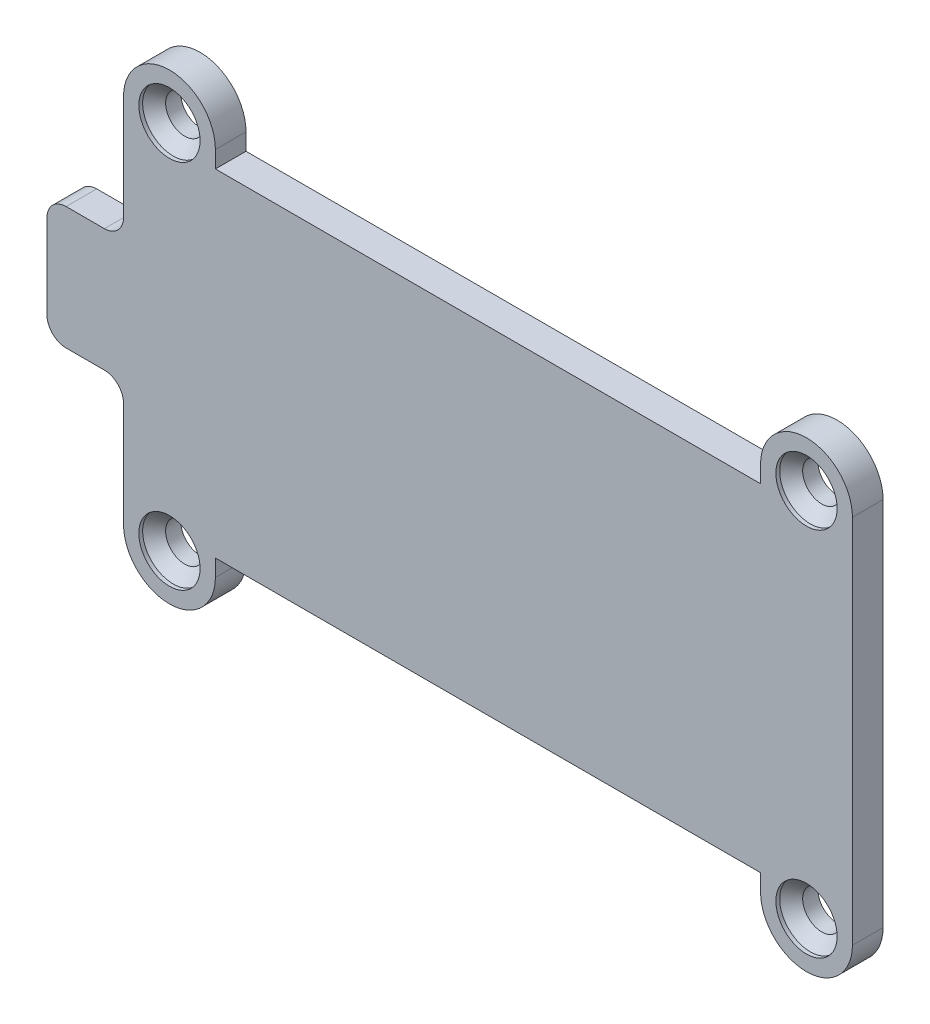
ISO-10303-21;
HEADER;
FILE_DESCRIPTION(('STEP AP214'),'2;1');
FILE_NAME('part.step','',(''),(''),'','','');
FILE_SCHEMA(('AUTOMOTIVE_DESIGN { 1 0 10303 214 1 1 1 1 }'));
ENDSEC;
DATA;
#1=APPLICATION_CONTEXT('core data for automotive mechanical design processes');
#2=APPLICATION_PROTOCOL_DEFINITION('international standard','automotive_design',2000,#1);
#3=PRODUCT_CONTEXT('',#1,'mechanical');
#4=PRODUCT('Part','Part','',(#3));
#5=PRODUCT_RELATED_PRODUCT_CATEGORY('part','',(#4));
#6=PRODUCT_DEFINITION_FORMATION('','',#4);
#7=PRODUCT_DEFINITION_CONTEXT('part definition',#1,'design');
#8=PRODUCT_DEFINITION('design','',#6,#7);
#9=PRODUCT_DEFINITION_SHAPE('','',#8);
#10=(LENGTH_UNIT() NAMED_UNIT(*) SI_UNIT(.MILLI.,.METRE.));
#11=(NAMED_UNIT(*) PLANE_ANGLE_UNIT() SI_UNIT($,.RADIAN.));
#12=(NAMED_UNIT(*) SI_UNIT($,.STERADIAN.) SOLID_ANGLE_UNIT());
#13=UNCERTAINTY_MEASURE_WITH_UNIT(LENGTH_MEASURE(1.E-05),#10,'distance_accuracy_value','');
#14=(GEOMETRIC_REPRESENTATION_CONTEXT(3) GLOBAL_UNCERTAINTY_ASSIGNED_CONTEXT((#13)) GLOBAL_UNIT_ASSIGNED_CONTEXT((#10,
#11,#12)) REPRESENTATION_CONTEXT('',''));
#15=CARTESIAN_POINT('',(0.,0.,0.));
#16=DIRECTION('',(0.,0.,1.));
#17=DIRECTION('',(1.,0.,0.));
#18=AXIS2_PLACEMENT_3D('',#15,#16,#17);
#19=CARTESIAN_POINT('',(-25.0500000000001,5.25,2.));
#20=DIRECTION('',(0.,0.,1.));
#21=DIRECTION('',(1.,0.,0.));
#22=AXIS2_PLACEMENT_3D('',#19,#20,#21);
#23=PLANE('',#22);
#24=CARTESIAN_POINT('',(-20.8,12.1,2.));
#25=DIRECTION('',(0.,0.,1.));
#26=DIRECTION('',(1.,0.,0.));
#27=AXIS2_PLACEMENT_3D('',#24,#25,#26);
#28=CIRCLE('',#27,2.);
#29=CARTESIAN_POINT('',(-18.8,12.1,2.));
#30=VERTEX_POINT('',#29);
#31=EDGE_CURVE('E450',#30,#30,#28,.T.);
#32=ORIENTED_EDGE('',*,*,#31,.F.);
#33=EDGE_LOOP('',(#32));
#34=FACE_BOUND('',#33,.T.);
#35=CARTESIAN_POINT('',(20.8,12.1,2.));
#36=DIRECTION('',(0.,0.,1.));
#37=DIRECTION('',(1.,0.,0.));
#38=AXIS2_PLACEMENT_3D('',#35,#36,#37);
#39=CIRCLE('',#38,2.);
#40=CARTESIAN_POINT('',(22.8,12.1,2.));
#41=VERTEX_POINT('',#40);
#42=EDGE_CURVE('E309',#41,#41,#39,.T.);
#43=ORIENTED_EDGE('',*,*,#42,.F.);
#44=EDGE_LOOP('',(#43));
#45=FACE_BOUND('',#44,.T.);
#46=CARTESIAN_POINT('',(20.8,-12.1,2.));
#47=DIRECTION('',(0.,0.,1.));
#48=DIRECTION('',(1.,0.,0.));
#49=AXIS2_PLACEMENT_3D('',#46,#47,#48);
#50=CIRCLE('',#49,2.);
#51=CARTESIAN_POINT('',(22.8,-12.1,2.));
#52=VERTEX_POINT('',#51);
#53=EDGE_CURVE('E302',#52,#52,#50,.T.);
#54=ORIENTED_EDGE('',*,*,#53,.F.);
#55=EDGE_LOOP('',(#54));
#56=FACE_BOUND('',#55,.T.);
#57=CARTESIAN_POINT('',(-20.8,-12.1,2.));
#58=DIRECTION('',(0.,0.,1.));
#59=DIRECTION('',(1.,0.,0.));
#60=AXIS2_PLACEMENT_3D('',#57,#58,#59);
#61=CIRCLE('',#60,2.);
#62=CARTESIAN_POINT('',(-18.8,-12.1,2.));
#63=VERTEX_POINT('',#62);
#64=EDGE_CURVE('E298',#63,#63,#61,.T.);
#65=ORIENTED_EDGE('',*,*,#64,.F.);
#66=EDGE_LOOP('',(#65));
#67=FACE_BOUND('',#66,.T.);
#68=CARTESIAN_POINT('',(-25.0500000000001,5.25,2.));
#69=DIRECTION('',(0.,0.,-1.));
#70=DIRECTION('',(1.,0.,0.));
#71=AXIS2_PLACEMENT_3D('',#68,#69,#70);
#72=CIRCLE('',#71,1.25);
#73=CARTESIAN_POINT('',(-23.8000000000001,5.24999999999998,2.));
#74=VERTEX_POINT('',#73);
#75=CARTESIAN_POINT('',(-25.0500000000001,4.,2.));
#76=VERTEX_POINT('',#75);
#77=EDGE_CURVE('E243',#74,#76,#72,.T.);
#78=ORIENTED_EDGE('',*,*,#77,.T.);
#79=DIRECTION('',(-1.,0.,0.));
#80=VECTOR('',#79,1.);
#81=CARTESIAN_POINT('',(-25.0500000000001,4.,2.));
#82=LINE('',#81,#80);
#83=CARTESIAN_POINT('',(-27.55,4.,2.));
#84=VERTEX_POINT('',#83);
#85=EDGE_CURVE('E131',#76,#84,#82,.T.);
#86=ORIENTED_EDGE('',*,*,#85,.T.);
#87=CARTESIAN_POINT('',(-27.55,2.75,2.));
#88=DIRECTION('',(0.,0.,1.));
#89=DIRECTION('',(1.,0.,0.));
#90=AXIS2_PLACEMENT_3D('',#87,#88,#89);
#91=CIRCLE('',#90,1.25);
#92=CARTESIAN_POINT('',(-28.8,2.75,2.));
#93=VERTEX_POINT('',#92);
#94=EDGE_CURVE('E335',#84,#93,#91,.T.);
#95=ORIENTED_EDGE('',*,*,#94,.T.);
#96=DIRECTION('',(0.,-1.,0.));
#97=VECTOR('',#96,1.);
#98=CARTESIAN_POINT('',(-28.8,2.75,2.));
#99=LINE('',#98,#97);
#100=CARTESIAN_POINT('',(-28.8,-2.75,2.));
#101=VERTEX_POINT('',#100);
#102=EDGE_CURVE('E337',#93,#101,#99,.T.);
#103=ORIENTED_EDGE('',*,*,#102,.T.);
#104=CARTESIAN_POINT('',(-27.55,-2.75,2.));
#105=DIRECTION('',(0.,0.,1.));
#106=DIRECTION('',(1.,0.,0.));
#107=AXIS2_PLACEMENT_3D('',#104,#105,#106);
#108=CIRCLE('',#107,1.25);
#109=CARTESIAN_POINT('',(-27.55,-4.,2.));
#110=VERTEX_POINT('',#109);
#111=EDGE_CURVE('E339',#101,#110,#108,.T.);
#112=ORIENTED_EDGE('',*,*,#111,.T.);
#113=DIRECTION('',(1.,0.,0.));
#114=VECTOR('',#113,1.);
#115=CARTESIAN_POINT('',(-27.55,-4.,2.));
#116=LINE('',#115,#114);
#117=CARTESIAN_POINT('',(-25.05,-4.,2.));
#118=VERTEX_POINT('',#117);
#119=EDGE_CURVE('E341',#110,#118,#116,.T.);
#120=ORIENTED_EDGE('',*,*,#119,.T.);
#121=CARTESIAN_POINT('',(-25.05,-5.25,2.));
#122=DIRECTION('',(0.,0.,-1.));
#123=DIRECTION('',(1.,0.,0.));
#124=AXIS2_PLACEMENT_3D('',#121,#122,#123);
#125=CIRCLE('',#124,1.25);
#126=CARTESIAN_POINT('',(-23.8,-5.25,2.));
#127=VERTEX_POINT('',#126);
#128=EDGE_CURVE('E343',#118,#127,#125,.T.);
#129=ORIENTED_EDGE('',*,*,#128,.T.);
#130=DIRECTION('',(0.,-1.,0.));
#131=VECTOR('',#130,1.);
#132=CARTESIAN_POINT('',(-23.8,-5.25,2.));
#133=LINE('',#132,#131);
#134=CARTESIAN_POINT('',(-23.8,-12.1,2.));
#135=VERTEX_POINT('',#134);
#136=EDGE_CURVE('E345',#127,#135,#133,.T.);
#137=ORIENTED_EDGE('',*,*,#136,.T.);
#138=CARTESIAN_POINT('',(-20.8,-12.1,2.));
#139=DIRECTION('',(0.,0.,1.));
#140=DIRECTION('',(1.,0.,0.));
#141=AXIS2_PLACEMENT_3D('',#138,#139,#140);
#142=CIRCLE('',#141,3.);
#143=CARTESIAN_POINT('',(-17.8,-12.1,2.));
#144=VERTEX_POINT('',#143);
#145=EDGE_CURVE('E347',#135,#144,#142,.T.);
#146=ORIENTED_EDGE('',*,*,#145,.T.);
#147=DIRECTION('',(0.,1.,0.));
#148=VECTOR('',#147,1.);
#149=CARTESIAN_POINT('',(-17.8,-12.1,2.));
#150=LINE('',#149,#148);
#151=CARTESIAN_POINT('',(-17.8,-11.,2.));
#152=VERTEX_POINT('',#151);
#153=EDGE_CURVE('E349',#144,#152,#150,.T.);
#154=ORIENTED_EDGE('',*,*,#153,.T.);
#155=DIRECTION('',(1.,0.,0.));
#156=VECTOR('',#155,1.);
#157=CARTESIAN_POINT('',(-17.8,-11.,2.));
#158=LINE('',#157,#156);
#159=CARTESIAN_POINT('',(17.8,-11.,2.));
#160=VERTEX_POINT('',#159);
#161=EDGE_CURVE('E351',#152,#160,#158,.T.);
#162=ORIENTED_EDGE('',*,*,#161,.T.);
#163=DIRECTION('',(0.,-1.,0.));
#164=VECTOR('',#163,1.);
#165=CARTESIAN_POINT('',(17.8,-11.,2.));
#166=LINE('',#165,#164);
#167=CARTESIAN_POINT('',(17.8,-12.1,2.));
#168=VERTEX_POINT('',#167);
#169=EDGE_CURVE('E353',#160,#168,#166,.T.);
#170=ORIENTED_EDGE('',*,*,#169,.T.);
#171=CARTESIAN_POINT('',(20.8,-12.1,2.));
#172=DIRECTION('',(0.,0.,1.));
#173=DIRECTION('',(1.,0.,0.));
#174=AXIS2_PLACEMENT_3D('',#171,#172,#173);
#175=CIRCLE('',#174,3.);
#176=CARTESIAN_POINT('',(23.8,-12.1,2.));
#177=VERTEX_POINT('',#176);
#178=EDGE_CURVE('E355',#168,#177,#175,.T.);
#179=ORIENTED_EDGE('',*,*,#178,.T.);
#180=DIRECTION('',(0.,1.,0.));
#181=VECTOR('',#180,1.);
#182=CARTESIAN_POINT('',(23.8,12.1,2.));
#183=LINE('',#182,#181);
#184=CARTESIAN_POINT('',(23.8,12.1,2.));
#185=VERTEX_POINT('',#184);
#186=EDGE_CURVE('E357',#177,#185,#183,.T.);
#187=ORIENTED_EDGE('',*,*,#186,.T.);
#188=CARTESIAN_POINT('',(20.8,12.1,2.));
#189=DIRECTION('',(0.,0.,1.));
#190=DIRECTION('',(1.,0.,0.));
#191=AXIS2_PLACEMENT_3D('',#188,#189,#190);
#192=CIRCLE('',#191,3.);
#193=CARTESIAN_POINT('',(17.8,12.1,2.));
#194=VERTEX_POINT('',#193);
#195=EDGE_CURVE('E359',#185,#194,#192,.T.);
#196=ORIENTED_EDGE('',*,*,#195,.T.);
#197=DIRECTION('',(0.,-1.,0.));
#198=VECTOR('',#197,1.);
#199=CARTESIAN_POINT('',(17.8,12.1,2.));
#200=LINE('',#199,#198);
#201=CARTESIAN_POINT('',(17.8,11.,2.));
#202=VERTEX_POINT('',#201);
#203=EDGE_CURVE('E361',#194,#202,#200,.T.);
#204=ORIENTED_EDGE('',*,*,#203,.T.);
#205=DIRECTION('',(-1.,0.,0.));
#206=VECTOR('',#205,1.);
#207=CARTESIAN_POINT('',(17.8,11.,2.));
#208=LINE('',#207,#206);
#209=CARTESIAN_POINT('',(-17.8,11.,2.));
#210=VERTEX_POINT('',#209);
#211=EDGE_CURVE('E185',#202,#210,#208,.T.);
#212=ORIENTED_EDGE('',*,*,#211,.T.);
#213=DIRECTION('',(0.,1.,0.));
#214=VECTOR('',#213,1.);
#215=CARTESIAN_POINT('',(-17.8,11.,2.));
#216=LINE('',#215,#214);
#217=CARTESIAN_POINT('',(-17.8,12.1,2.));
#218=VERTEX_POINT('',#217);
#219=EDGE_CURVE('E180',#210,#218,#216,.T.);
#220=ORIENTED_EDGE('',*,*,#219,.T.);
#221=CARTESIAN_POINT('',(-20.8,12.1,2.));
#222=DIRECTION('',(0.,0.,1.));
#223=DIRECTION('',(1.,0.,0.));
#224=AXIS2_PLACEMENT_3D('',#221,#222,#223);
#225=CIRCLE('',#224,3.);
#226=CARTESIAN_POINT('',(-23.8,12.1,2.));
#227=VERTEX_POINT('',#226);
#228=EDGE_CURVE('E183',#218,#227,#225,.T.);
#229=ORIENTED_EDGE('',*,*,#228,.T.);
#230=DIRECTION('',(0.,-1.,0.));
#231=VECTOR('',#230,1.);
#232=CARTESIAN_POINT('',(-23.8,12.1,2.));
#233=LINE('',#232,#231);
#234=EDGE_CURVE('E52',#227,#74,#233,.T.);
#235=ORIENTED_EDGE('',*,*,#234,.T.);
#236=EDGE_LOOP('',(#78,#86,#95,#103,#112,#120,#129,#137,#146,#154,#162,#170,#179,#187,#196,#204,
#212,#220,#229,#235));
#237=FACE_BOUND('',#236,.T.);
#238=ADVANCED_FACE('F33',(#34,#45,#56,#67,#237),#23,.T.);
#239=CARTESIAN_POINT('',(-25.0500000000001,5.25,0.));
#240=DIRECTION('',(0.,0.,1.));
#241=DIRECTION('',(1.,0.,0.));
#242=AXIS2_PLACEMENT_3D('',#239,#240,#241);
#243=PLANE('',#242);
#244=CARTESIAN_POINT('',(-25.0500000000001,5.25,0.));
#245=DIRECTION('',(0.,0.,-1.));
#246=DIRECTION('',(1.,0.,0.));
#247=AXIS2_PLACEMENT_3D('',#244,#245,#246);
#248=CIRCLE('',#247,1.25);
#249=CARTESIAN_POINT('',(-23.8000000000001,5.24999999999998,0.));
#250=VERTEX_POINT('',#249);
#251=CARTESIAN_POINT('',(-25.0500000000001,4.,0.));
#252=VERTEX_POINT('',#251);
#253=EDGE_CURVE('E203',#250,#252,#248,.T.);
#254=ORIENTED_EDGE('',*,*,#253,.F.);
#255=DIRECTION('',(0.,-1.,0.));
#256=VECTOR('',#255,1.);
#257=CARTESIAN_POINT('',(-23.8,12.1,0.));
#258=LINE('',#257,#256);
#259=CARTESIAN_POINT('',(-23.8,12.1,0.));
#260=VERTEX_POINT('',#259);
#261=EDGE_CURVE('E123',#260,#250,#258,.T.);
#262=ORIENTED_EDGE('',*,*,#261,.F.);
#263=CARTESIAN_POINT('',(-20.8,12.1,0.));
#264=DIRECTION('',(0.,0.,1.));
#265=DIRECTION('',(1.,0.,0.));
#266=AXIS2_PLACEMENT_3D('',#263,#264,#265);
#267=CIRCLE('',#266,3.);
#268=CARTESIAN_POINT('',(-17.8,12.1,0.));
#269=VERTEX_POINT('',#268);
#270=EDGE_CURVE('E117',#269,#260,#267,.T.);
#271=ORIENTED_EDGE('',*,*,#270,.F.);
#272=DIRECTION('',(0.,1.,0.));
#273=VECTOR('',#272,1.);
#274=CARTESIAN_POINT('',(-17.8,11.,0.));
#275=LINE('',#274,#273);
#276=CARTESIAN_POINT('',(-17.8,11.,0.));
#277=VERTEX_POINT('',#276);
#278=EDGE_CURVE('E193',#277,#269,#275,.T.);
#279=ORIENTED_EDGE('',*,*,#278,.F.);
#280=DIRECTION('',(-1.,0.,0.));
#281=VECTOR('',#280,1.);
#282=CARTESIAN_POINT('',(17.8,11.,0.));
#283=LINE('',#282,#281);
#284=CARTESIAN_POINT('',(17.8,11.,0.));
#285=VERTEX_POINT('',#284);
#286=EDGE_CURVE('E238',#285,#277,#283,.T.);
#287=ORIENTED_EDGE('',*,*,#286,.F.);
#288=DIRECTION('',(0.,-1.,0.));
#289=VECTOR('',#288,1.);
#290=CARTESIAN_POINT('',(17.8,12.1,0.));
#291=LINE('',#290,#289);
#292=CARTESIAN_POINT('',(17.8,12.1,0.));
#293=VERTEX_POINT('',#292);
#294=EDGE_CURVE('E236',#293,#285,#291,.T.);
#295=ORIENTED_EDGE('',*,*,#294,.F.);
#296=CARTESIAN_POINT('',(20.8,12.1,0.));
#297=DIRECTION('',(0.,0.,1.));
#298=DIRECTION('',(1.,0.,0.));
#299=AXIS2_PLACEMENT_3D('',#296,#297,#298);
#300=CIRCLE('',#299,3.);
#301=CARTESIAN_POINT('',(23.8,12.1,0.));
#302=VERTEX_POINT('',#301);
#303=EDGE_CURVE('E234',#302,#293,#300,.T.);
#304=ORIENTED_EDGE('',*,*,#303,.F.);
#305=DIRECTION('',(0.,1.,0.));
#306=VECTOR('',#305,1.);
#307=CARTESIAN_POINT('',(23.8,12.1,0.));
#308=LINE('',#307,#306);
#309=CARTESIAN_POINT('',(23.8,-12.1,0.));
#310=VERTEX_POINT('',#309);
#311=EDGE_CURVE('E232',#310,#302,#308,.T.);
#312=ORIENTED_EDGE('',*,*,#311,.F.);
#313=CARTESIAN_POINT('',(20.8,-12.1,0.));
#314=DIRECTION('',(0.,0.,1.));
#315=DIRECTION('',(1.,0.,0.));
#316=AXIS2_PLACEMENT_3D('',#313,#314,#315);
#317=CIRCLE('',#316,3.);
#318=CARTESIAN_POINT('',(17.8,-12.1,0.));
#319=VERTEX_POINT('',#318);
#320=EDGE_CURVE('E230',#319,#310,#317,.T.);
#321=ORIENTED_EDGE('',*,*,#320,.F.);
#322=DIRECTION('',(0.,-1.,0.));
#323=VECTOR('',#322,1.);
#324=CARTESIAN_POINT('',(17.8,-11.,0.));
#325=LINE('',#324,#323);
#326=CARTESIAN_POINT('',(17.8,-11.,0.));
#327=VERTEX_POINT('',#326);
#328=EDGE_CURVE('E228',#327,#319,#325,.T.);
#329=ORIENTED_EDGE('',*,*,#328,.F.);
#330=DIRECTION('',(1.,0.,0.));
#331=VECTOR('',#330,1.);
#332=CARTESIAN_POINT('',(-17.8,-11.,0.));
#333=LINE('',#332,#331);
#334=CARTESIAN_POINT('',(-17.8,-11.,0.));
#335=VERTEX_POINT('',#334);
#336=EDGE_CURVE('E226',#335,#327,#333,.T.);
#337=ORIENTED_EDGE('',*,*,#336,.F.);
#338=DIRECTION('',(0.,1.,0.));
#339=VECTOR('',#338,1.);
#340=CARTESIAN_POINT('',(-17.8,-12.1,0.));
#341=LINE('',#340,#339);
#342=CARTESIAN_POINT('',(-17.8,-12.1,0.));
#343=VERTEX_POINT('',#342);
#344=EDGE_CURVE('E224',#343,#335,#341,.T.);
#345=ORIENTED_EDGE('',*,*,#344,.F.);
#346=CARTESIAN_POINT('',(-20.8,-12.1,0.));
#347=DIRECTION('',(0.,0.,1.));
#348=DIRECTION('',(1.,0.,0.));
#349=AXIS2_PLACEMENT_3D('',#346,#347,#348);
#350=CIRCLE('',#349,3.);
#351=CARTESIAN_POINT('',(-23.8,-12.1,0.));
#352=VERTEX_POINT('',#351);
#353=EDGE_CURVE('E222',#352,#343,#350,.T.);
#354=ORIENTED_EDGE('',*,*,#353,.F.);
#355=DIRECTION('',(0.,-1.,0.));
#356=VECTOR('',#355,1.);
#357=CARTESIAN_POINT('',(-23.8,-5.25,0.));
#358=LINE('',#357,#356);
#359=CARTESIAN_POINT('',(-23.8,-5.25,0.));
#360=VERTEX_POINT('',#359);
#361=EDGE_CURVE('E220',#360,#352,#358,.T.);
#362=ORIENTED_EDGE('',*,*,#361,.F.);
#363=CARTESIAN_POINT('',(-25.05,-5.25,0.));
#364=DIRECTION('',(0.,0.,-1.));
#365=DIRECTION('',(1.,0.,0.));
#366=AXIS2_PLACEMENT_3D('',#363,#364,#365);
#367=CIRCLE('',#366,1.25);
#368=CARTESIAN_POINT('',(-25.05,-4.,0.));
#369=VERTEX_POINT('',#368);
#370=EDGE_CURVE('E218',#369,#360,#367,.T.);
#371=ORIENTED_EDGE('',*,*,#370,.F.);
#372=DIRECTION('',(1.,0.,0.));
#373=VECTOR('',#372,1.);
#374=CARTESIAN_POINT('',(-27.55,-4.,0.));
#375=LINE('',#374,#373);
#376=CARTESIAN_POINT('',(-27.55,-4.,0.));
#377=VERTEX_POINT('',#376);
#378=EDGE_CURVE('E216',#377,#369,#375,.T.);
#379=ORIENTED_EDGE('',*,*,#378,.F.);
#380=CARTESIAN_POINT('',(-27.55,-2.75,0.));
#381=DIRECTION('',(0.,0.,1.));
#382=DIRECTION('',(1.,0.,0.));
#383=AXIS2_PLACEMENT_3D('',#380,#381,#382);
#384=CIRCLE('',#383,1.25);
#385=CARTESIAN_POINT('',(-28.8,-2.75,0.));
#386=VERTEX_POINT('',#385);
#387=EDGE_CURVE('E214',#386,#377,#384,.T.);
#388=ORIENTED_EDGE('',*,*,#387,.F.);
#389=DIRECTION('',(0.,-1.,0.));
#390=VECTOR('',#389,1.);
#391=CARTESIAN_POINT('',(-28.8,-2.25,0.));
#392=LINE('',#391,#390);
#393=CARTESIAN_POINT('',(-28.8,2.75,0.));
#394=VERTEX_POINT('',#393);
#395=EDGE_CURVE('E212',#394,#386,#392,.T.);
#396=ORIENTED_EDGE('',*,*,#395,.F.);
#397=CARTESIAN_POINT('',(-27.55,2.75,0.));
#398=DIRECTION('',(0.,0.,1.));
#399=DIRECTION('',(1.,0.,0.));
#400=AXIS2_PLACEMENT_3D('',#397,#398,#399);
#401=CIRCLE('',#400,1.25);
#402=CARTESIAN_POINT('',(-27.55,4.,0.));
#403=VERTEX_POINT('',#402);
#404=EDGE_CURVE('E209',#403,#394,#401,.T.);
#405=ORIENTED_EDGE('',*,*,#404,.F.);
#406=DIRECTION('',(-1.,0.,0.));
#407=VECTOR('',#406,1.);
#408=CARTESIAN_POINT('',(-25.0500000000001,4.,0.));
#409=LINE('',#408,#407);
#410=EDGE_CURVE('E206',#252,#403,#409,.T.);
#411=ORIENTED_EDGE('',*,*,#410,.F.);
#412=EDGE_LOOP('',(#254,#262,#271,#279,#287,#295,#304,#312,#321,#329,#337,#345,#354,#362,#371,
#379,#388,#396,#405,#411));
#413=FACE_BOUND('',#412,.T.);
#414=CARTESIAN_POINT('',(-20.8,12.1,0.));
#415=DIRECTION('',(0.,0.,1.));
#416=DIRECTION('',(1.,0.,0.));
#417=AXIS2_PLACEMENT_3D('',#414,#415,#416);
#418=CIRCLE('',#417,1.25);
#419=CARTESIAN_POINT('',(-19.55,12.1,0.));
#420=VERTEX_POINT('',#419);
#421=EDGE_CURVE('E207',#420,#420,#418,.T.);
#422=ORIENTED_EDGE('',*,*,#421,.T.);
#423=EDGE_LOOP('',(#422));
#424=FACE_BOUND('',#423,.T.);
#425=CARTESIAN_POINT('',(20.8,12.1,0.));
#426=DIRECTION('',(0.,0.,1.));
#427=DIRECTION('',(1.,0.,0.));
#428=AXIS2_PLACEMENT_3D('',#425,#426,#427);
#429=CIRCLE('',#428,1.25);
#430=CARTESIAN_POINT('',(22.05,12.1,0.));
#431=VERTEX_POINT('',#430);
#432=EDGE_CURVE('E328',#431,#431,#429,.T.);
#433=ORIENTED_EDGE('',*,*,#432,.T.);
#434=EDGE_LOOP('',(#433));
#435=FACE_BOUND('',#434,.T.);
#436=CARTESIAN_POINT('',(20.8,-12.1,0.));
#437=DIRECTION('',(0.,0.,1.));
#438=DIRECTION('',(1.,0.,0.));
#439=AXIS2_PLACEMENT_3D('',#436,#437,#438);
#440=CIRCLE('',#439,1.25);
#441=CARTESIAN_POINT('',(22.05,-12.1,0.));
#442=VERTEX_POINT('',#441);
#443=EDGE_CURVE('E325',#442,#442,#440,.T.);
#444=ORIENTED_EDGE('',*,*,#443,.T.);
#445=EDGE_LOOP('',(#444));
#446=FACE_BOUND('',#445,.T.);
#447=CARTESIAN_POINT('',(-20.8,-12.1,0.));
#448=DIRECTION('',(0.,0.,1.));
#449=DIRECTION('',(1.,0.,0.));
#450=AXIS2_PLACEMENT_3D('',#447,#448,#449);
#451=CIRCLE('',#450,1.25);
#452=CARTESIAN_POINT('',(-19.55,-12.1,0.));
#453=VERTEX_POINT('',#452);
#454=EDGE_CURVE('E294',#453,#453,#451,.T.);
#455=ORIENTED_EDGE('',*,*,#454,.T.);
#456=EDGE_LOOP('',(#455));
#457=FACE_BOUND('',#456,.T.);
#458=ADVANCED_FACE('F374',(#413,#424,#435,#446,#457),#243,.F.);
#459=CARTESIAN_POINT('',(-25.0500000000001,5.25,2.));
#460=DIRECTION('',(0.,0.,-1.));
#461=DIRECTION('',(-1.,0.,0.));
#462=AXIS2_PLACEMENT_3D('',#459,#460,#461);
#463=CYLINDRICAL_SURFACE('',#462,1.25);
#464=ORIENTED_EDGE('',*,*,#253,.T.);
#465=DIRECTION('',(0.,0.,-1.));
#466=VECTOR('',#465,1.);
#467=CARTESIAN_POINT('',(-25.0500000000001,4.,2.));
#468=LINE('',#467,#466);
#469=EDGE_CURVE('E11',#76,#252,#468,.T.);
#470=ORIENTED_EDGE('',*,*,#469,.F.);
#471=ORIENTED_EDGE('',*,*,#77,.F.);
#472=DIRECTION('',(0.,0.,-1.));
#473=VECTOR('',#472,1.);
#474=CARTESIAN_POINT('',(-23.8000000000001,5.24999999999998,2.));
#475=LINE('',#474,#473);
#476=EDGE_CURVE('E199',#74,#250,#475,.T.);
#477=ORIENTED_EDGE('',*,*,#476,.T.);
#478=EDGE_LOOP('',(#464,#470,#471,#477));
#479=FACE_BOUND('',#478,.T.);
#480=ADVANCED_FACE('F35',(#479),#463,.F.);
#481=CARTESIAN_POINT('',(-25.0500000000001,4.,2.));
#482=DIRECTION('',(0.,-1.,0.));
#483=DIRECTION('',(0.,0.,-1.));
#484=AXIS2_PLACEMENT_3D('',#481,#482,#483);
#485=PLANE('',#484);
#486=ORIENTED_EDGE('',*,*,#410,.T.);
#487=DIRECTION('',(0.,0.,-1.));
#488=VECTOR('',#487,1.);
#489=CARTESIAN_POINT('',(-27.55,4.,2.));
#490=LINE('',#489,#488);
#491=EDGE_CURVE('E43',#84,#403,#490,.T.);
#492=ORIENTED_EDGE('',*,*,#491,.F.);
#493=ORIENTED_EDGE('',*,*,#85,.F.);
#494=ORIENTED_EDGE('',*,*,#469,.T.);
#495=EDGE_LOOP('',(#486,#492,#493,#494));
#496=FACE_BOUND('',#495,.T.);
#497=ADVANCED_FACE('F680',(#496),#485,.F.);
#498=CARTESIAN_POINT('',(-27.55,2.75,2.));
#499=DIRECTION('',(0.,0.,-1.));
#500=DIRECTION('',(-1.,0.,0.));
#501=AXIS2_PLACEMENT_3D('',#498,#499,#500);
#502=CYLINDRICAL_SURFACE('',#501,1.25);
#503=ORIENTED_EDGE('',*,*,#404,.T.);
#504=DIRECTION('',(0.,0.,-1.));
#505=VECTOR('',#504,1.);
#506=CARTESIAN_POINT('',(-28.8,2.75,2.));
#507=LINE('',#506,#505);
#508=EDGE_CURVE('E286',#93,#394,#507,.T.);
#509=ORIENTED_EDGE('',*,*,#508,.F.);
#510=ORIENTED_EDGE('',*,*,#94,.F.);
#511=ORIENTED_EDGE('',*,*,#491,.T.);
#512=EDGE_LOOP('',(#503,#509,#510,#511));
#513=FACE_BOUND('',#512,.T.);
#514=ADVANCED_FACE('F669',(#513),#502,.T.);
#515=CARTESIAN_POINT('',(-28.8,-2.25,2.));
#516=DIRECTION('',(1.,0.,0.));
#517=DIRECTION('',(0.,0.,-1.));
#518=AXIS2_PLACEMENT_3D('',#515,#516,#517);
#519=PLANE('',#518);
#520=ORIENTED_EDGE('',*,*,#395,.T.);
#521=DIRECTION('',(0.,0.,-1.));
#522=VECTOR('',#521,1.);
#523=CARTESIAN_POINT('',(-28.8,-2.75,2.));
#524=LINE('',#523,#522);
#525=EDGE_CURVE('E283',#101,#386,#524,.T.);
#526=ORIENTED_EDGE('',*,*,#525,.F.);
#527=ORIENTED_EDGE('',*,*,#102,.F.);
#528=ORIENTED_EDGE('',*,*,#508,.T.);
#529=EDGE_LOOP('',(#520,#526,#527,#528));
#530=FACE_BOUND('',#529,.T.);
#531=ADVANCED_FACE('F659',(#530),#519,.F.);
#532=CARTESIAN_POINT('',(-27.55,-2.75,2.));
#533=DIRECTION('',(0.,0.,-1.));
#534=DIRECTION('',(-1.,0.,0.));
#535=AXIS2_PLACEMENT_3D('',#532,#533,#534);
#536=CYLINDRICAL_SURFACE('',#535,1.25);
#537=ORIENTED_EDGE('',*,*,#387,.T.);
#538=DIRECTION('',(0.,0.,-1.));
#539=VECTOR('',#538,1.);
#540=CARTESIAN_POINT('',(-27.55,-4.,2.));
#541=LINE('',#540,#539);
#542=EDGE_CURVE('E280',#110,#377,#541,.T.);
#543=ORIENTED_EDGE('',*,*,#542,.F.);
#544=ORIENTED_EDGE('',*,*,#111,.F.);
#545=ORIENTED_EDGE('',*,*,#525,.T.);
#546=EDGE_LOOP('',(#537,#543,#544,#545));
#547=FACE_BOUND('',#546,.T.);
#548=ADVANCED_FACE('F649',(#547),#536,.T.);
#549=CARTESIAN_POINT('',(-27.55,-4.,2.));
#550=DIRECTION('',(0.,1.,0.));
#551=DIRECTION('',(-1.,0.,0.));
#552=AXIS2_PLACEMENT_3D('',#549,#550,#551);
#553=PLANE('',#552);
#554=ORIENTED_EDGE('',*,*,#378,.T.);
#555=DIRECTION('',(0.,0.,-1.));
#556=VECTOR('',#555,1.);
#557=CARTESIAN_POINT('',(-25.05,-4.,2.));
#558=LINE('',#557,#556);
#559=EDGE_CURVE('E277',#118,#369,#558,.T.);
#560=ORIENTED_EDGE('',*,*,#559,.F.);
#561=ORIENTED_EDGE('',*,*,#119,.F.);
#562=ORIENTED_EDGE('',*,*,#542,.T.);
#563=EDGE_LOOP('',(#554,#560,#561,#562));
#564=FACE_BOUND('',#563,.T.);
#565=ADVANCED_FACE('F639',(#564),#553,.F.);
#566=CARTESIAN_POINT('',(-25.05,-5.25,2.));
#567=DIRECTION('',(0.,0.,-1.));
#568=DIRECTION('',(-1.,0.,0.));
#569=AXIS2_PLACEMENT_3D('',#566,#567,#568);
#570=CYLINDRICAL_SURFACE('',#569,1.25);
#571=ORIENTED_EDGE('',*,*,#370,.T.);
#572=DIRECTION('',(0.,0.,-1.));
#573=VECTOR('',#572,1.);
#574=CARTESIAN_POINT('',(-23.8,-5.25,2.));
#575=LINE('',#574,#573);
#576=EDGE_CURVE('E274',#127,#360,#575,.T.);
#577=ORIENTED_EDGE('',*,*,#576,.F.);
#578=ORIENTED_EDGE('',*,*,#128,.F.);
#579=ORIENTED_EDGE('',*,*,#559,.T.);
#580=EDGE_LOOP('',(#571,#577,#578,#579));
#581=FACE_BOUND('',#580,.T.);
#582=ADVANCED_FACE('F629',(#581),#570,.F.);
#583=CARTESIAN_POINT('',(-23.8,-5.25,2.));
#584=DIRECTION('',(1.,0.,0.));
#585=DIRECTION('',(0.,1.,0.));
#586=AXIS2_PLACEMENT_3D('',#583,#584,#585);
#587=PLANE('',#586);
#588=ORIENTED_EDGE('',*,*,#361,.T.);
#589=DIRECTION('',(0.,0.,-1.));
#590=VECTOR('',#589,1.);
#591=CARTESIAN_POINT('',(-23.8,-12.1,2.));
#592=LINE('',#591,#590);
#593=EDGE_CURVE('E271',#135,#352,#592,.T.);
#594=ORIENTED_EDGE('',*,*,#593,.F.);
#595=ORIENTED_EDGE('',*,*,#136,.F.);
#596=ORIENTED_EDGE('',*,*,#576,.T.);
#597=EDGE_LOOP('',(#588,#594,#595,#596));
#598=FACE_BOUND('',#597,.T.);
#599=ADVANCED_FACE('F619',(#598),#587,.F.);
#600=CARTESIAN_POINT('',(-20.8,-12.1,2.));
#601=DIRECTION('',(0.,0.,-1.));
#602=DIRECTION('',(-1.,0.,0.));
#603=AXIS2_PLACEMENT_3D('',#600,#601,#602);
#604=CYLINDRICAL_SURFACE('',#603,3.);
#605=ORIENTED_EDGE('',*,*,#353,.T.);
#606=DIRECTION('',(0.,0.,-1.));
#607=VECTOR('',#606,1.);
#608=CARTESIAN_POINT('',(-17.8,-12.1,2.));
#609=LINE('',#608,#607);
#610=EDGE_CURVE('E268',#144,#343,#609,.T.);
#611=ORIENTED_EDGE('',*,*,#610,.F.);
#612=ORIENTED_EDGE('',*,*,#145,.F.);
#613=ORIENTED_EDGE('',*,*,#593,.T.);
#614=EDGE_LOOP('',(#605,#611,#612,#613));
#615=FACE_BOUND('',#614,.T.);
#616=ADVANCED_FACE('F609',(#615),#604,.T.);
#617=CARTESIAN_POINT('',(-17.8,-12.1,2.));
#618=DIRECTION('',(-1.,0.,0.));
#619=DIRECTION('',(0.,-1.,0.));
#620=AXIS2_PLACEMENT_3D('',#617,#618,#619);
#621=PLANE('',#620);
#622=ORIENTED_EDGE('',*,*,#344,.T.);
#623=DIRECTION('',(0.,0.,-1.));
#624=VECTOR('',#623,1.);
#625=CARTESIAN_POINT('',(-17.8,-11.,2.));
#626=LINE('',#625,#624);
#627=EDGE_CURVE('E265',#152,#335,#626,.T.);
#628=ORIENTED_EDGE('',*,*,#627,.F.);
#629=ORIENTED_EDGE('',*,*,#153,.F.);
#630=ORIENTED_EDGE('',*,*,#610,.T.);
#631=EDGE_LOOP('',(#622,#628,#629,#630));
#632=FACE_BOUND('',#631,.T.);
#633=ADVANCED_FACE('F599',(#632),#621,.F.);
#634=CARTESIAN_POINT('',(-17.8,-11.,2.));
#635=DIRECTION('',(0.,1.,0.));
#636=DIRECTION('',(-1.,0.,0.));
#637=AXIS2_PLACEMENT_3D('',#634,#635,#636);
#638=PLANE('',#637);
#639=ORIENTED_EDGE('',*,*,#336,.T.);
#640=DIRECTION('',(0.,0.,-1.));
#641=VECTOR('',#640,1.);
#642=CARTESIAN_POINT('',(17.8,-11.,2.));
#643=LINE('',#642,#641);
#644=EDGE_CURVE('E262',#160,#327,#643,.T.);
#645=ORIENTED_EDGE('',*,*,#644,.F.);
#646=ORIENTED_EDGE('',*,*,#161,.F.);
#647=ORIENTED_EDGE('',*,*,#627,.T.);
#648=EDGE_LOOP('',(#639,#645,#646,#647));
#649=FACE_BOUND('',#648,.T.);
#650=ADVANCED_FACE('F589',(#649),#638,.F.);
#651=CARTESIAN_POINT('',(17.8,-11.,2.));
#652=DIRECTION('',(1.,0.,0.));
#653=DIRECTION('',(0.,0.,-1.));
#654=AXIS2_PLACEMENT_3D('',#651,#652,#653);
#655=PLANE('',#654);
#656=ORIENTED_EDGE('',*,*,#328,.T.);
#657=DIRECTION('',(0.,0.,-1.));
#658=VECTOR('',#657,1.);
#659=CARTESIAN_POINT('',(17.8,-12.1,2.));
#660=LINE('',#659,#658);
#661=EDGE_CURVE('E259',#168,#319,#660,.T.);
#662=ORIENTED_EDGE('',*,*,#661,.F.);
#663=ORIENTED_EDGE('',*,*,#169,.F.);
#664=ORIENTED_EDGE('',*,*,#644,.T.);
#665=EDGE_LOOP('',(#656,#662,#663,#664));
#666=FACE_BOUND('',#665,.T.);
#667=ADVANCED_FACE('F579',(#666),#655,.F.);
#668=CARTESIAN_POINT('',(20.8,-12.1,2.));
#669=DIRECTION('',(0.,0.,-1.));
#670=DIRECTION('',(-1.,0.,0.));
#671=AXIS2_PLACEMENT_3D('',#668,#669,#670);
#672=CYLINDRICAL_SURFACE('',#671,3.);
#673=ORIENTED_EDGE('',*,*,#320,.T.);
#674=DIRECTION('',(0.,0.,-1.));
#675=VECTOR('',#674,1.);
#676=CARTESIAN_POINT('',(23.8,-12.1,2.));
#677=LINE('',#676,#675);
#678=EDGE_CURVE('E256',#177,#310,#677,.T.);
#679=ORIENTED_EDGE('',*,*,#678,.F.);
#680=ORIENTED_EDGE('',*,*,#178,.F.);
#681=ORIENTED_EDGE('',*,*,#661,.T.);
#682=EDGE_LOOP('',(#673,#679,#680,#681));
#683=FACE_BOUND('',#682,.T.);
#684=ADVANCED_FACE('F569',(#683),#672,.T.);
#685=CARTESIAN_POINT('',(23.8,12.1,2.));
#686=DIRECTION('',(-1.,0.,0.));
#687=DIRECTION('',(0.,-1.,0.));
#688=AXIS2_PLACEMENT_3D('',#685,#686,#687);
#689=PLANE('',#688);
#690=ORIENTED_EDGE('',*,*,#311,.T.);
#691=DIRECTION('',(0.,0.,-1.));
#692=VECTOR('',#691,1.);
#693=CARTESIAN_POINT('',(23.8,12.1,2.));
#694=LINE('',#693,#692);
#695=EDGE_CURVE('E253',#185,#302,#694,.T.);
#696=ORIENTED_EDGE('',*,*,#695,.F.);
#697=ORIENTED_EDGE('',*,*,#186,.F.);
#698=ORIENTED_EDGE('',*,*,#678,.T.);
#699=EDGE_LOOP('',(#690,#696,#697,#698));
#700=FACE_BOUND('',#699,.T.);
#701=ADVANCED_FACE('F559',(#700),#689,.F.);
#702=CARTESIAN_POINT('',(20.8,12.1,2.));
#703=DIRECTION('',(0.,0.,-1.));
#704=DIRECTION('',(-1.,0.,0.));
#705=AXIS2_PLACEMENT_3D('',#702,#703,#704);
#706=CYLINDRICAL_SURFACE('',#705,3.);
#707=ORIENTED_EDGE('',*,*,#303,.T.);
#708=DIRECTION('',(0.,0.,-1.));
#709=VECTOR('',#708,1.);
#710=CARTESIAN_POINT('',(17.8,12.1,2.));
#711=LINE('',#710,#709);
#712=EDGE_CURVE('E250',#194,#293,#711,.T.);
#713=ORIENTED_EDGE('',*,*,#712,.F.);
#714=ORIENTED_EDGE('',*,*,#195,.F.);
#715=ORIENTED_EDGE('',*,*,#695,.T.);
#716=EDGE_LOOP('',(#707,#713,#714,#715));
#717=FACE_BOUND('',#716,.T.);
#718=ADVANCED_FACE('F550',(#717),#706,.T.);
#719=CARTESIAN_POINT('',(17.8,12.1,2.));
#720=DIRECTION('',(1.,0.,0.));
#721=DIRECTION('',(0.,0.,-1.));
#722=AXIS2_PLACEMENT_3D('',#719,#720,#721);
#723=PLANE('',#722);
#724=ORIENTED_EDGE('',*,*,#294,.T.);
#725=DIRECTION('',(0.,0.,-1.));
#726=VECTOR('',#725,1.);
#727=CARTESIAN_POINT('',(17.8,11.,2.));
#728=LINE('',#727,#726);
#729=EDGE_CURVE('E247',#202,#285,#728,.T.);
#730=ORIENTED_EDGE('',*,*,#729,.F.);
#731=ORIENTED_EDGE('',*,*,#203,.F.);
#732=ORIENTED_EDGE('',*,*,#712,.T.);
#733=EDGE_LOOP('',(#724,#730,#731,#732));
#734=FACE_BOUND('',#733,.T.);
#735=ADVANCED_FACE('F367',(#734),#723,.F.);
#736=CARTESIAN_POINT('',(17.8,11.,2.));
#737=DIRECTION('',(0.,-1.,0.));
#738=DIRECTION('',(1.,0.,0.));
#739=AXIS2_PLACEMENT_3D('',#736,#737,#738);
#740=PLANE('',#739);
#741=ORIENTED_EDGE('',*,*,#286,.T.);
#742=DIRECTION('',(0.,0.,-1.));
#743=VECTOR('',#742,1.);
#744=CARTESIAN_POINT('',(-17.8,11.,2.));
#745=LINE('',#744,#743);
#746=EDGE_CURVE('E194',#210,#277,#745,.T.);
#747=ORIENTED_EDGE('',*,*,#746,.F.);
#748=ORIENTED_EDGE('',*,*,#211,.F.);
#749=ORIENTED_EDGE('',*,*,#729,.T.);
#750=EDGE_LOOP('',(#741,#747,#748,#749));
#751=FACE_BOUND('',#750,.T.);
#752=ADVANCED_FACE('F371',(#751),#740,.F.);
#753=CARTESIAN_POINT('',(-17.8,11.,2.));
#754=DIRECTION('',(-1.,0.,0.));
#755=DIRECTION('',(0.,0.,1.));
#756=AXIS2_PLACEMENT_3D('',#753,#754,#755);
#757=PLANE('',#756);
#758=ORIENTED_EDGE('',*,*,#278,.T.);
#759=DIRECTION('',(0.,0.,-1.));
#760=VECTOR('',#759,1.);
#761=CARTESIAN_POINT('',(-17.8,12.1,2.));
#762=LINE('',#761,#760);
#763=EDGE_CURVE('E190',#218,#269,#762,.T.);
#764=ORIENTED_EDGE('',*,*,#763,.F.);
#765=ORIENTED_EDGE('',*,*,#219,.F.);
#766=ORIENTED_EDGE('',*,*,#746,.T.);
#767=EDGE_LOOP('',(#758,#764,#765,#766));
#768=FACE_BOUND('',#767,.T.);
#769=ADVANCED_FACE('F191',(#768),#757,.F.);
#770=CARTESIAN_POINT('',(-20.8,12.1,2.));
#771=DIRECTION('',(0.,0.,-1.));
#772=DIRECTION('',(-1.,0.,0.));
#773=AXIS2_PLACEMENT_3D('',#770,#771,#772);
#774=CYLINDRICAL_SURFACE('',#773,3.);
#775=ORIENTED_EDGE('',*,*,#270,.T.);
#776=DIRECTION('',(0.,0.,-1.));
#777=VECTOR('',#776,1.);
#778=CARTESIAN_POINT('',(-23.8,12.1,2.));
#779=LINE('',#778,#777);
#780=EDGE_CURVE('E195',#227,#260,#779,.T.);
#781=ORIENTED_EDGE('',*,*,#780,.F.);
#782=ORIENTED_EDGE('',*,*,#228,.F.);
#783=ORIENTED_EDGE('',*,*,#763,.T.);
#784=EDGE_LOOP('',(#775,#781,#782,#783));
#785=FACE_BOUND('',#784,.T.);
#786=ADVANCED_FACE('F197',(#785),#774,.T.);
#787=CARTESIAN_POINT('',(-23.8,12.1,2.));
#788=DIRECTION('',(1.,0.,0.));
#789=DIRECTION('',(0.,1.,0.));
#790=AXIS2_PLACEMENT_3D('',#787,#788,#789);
#791=PLANE('',#790);
#792=ORIENTED_EDGE('',*,*,#261,.T.);
#793=ORIENTED_EDGE('',*,*,#476,.F.);
#794=ORIENTED_EDGE('',*,*,#234,.F.);
#795=ORIENTED_EDGE('',*,*,#780,.T.);
#796=EDGE_LOOP('',(#792,#793,#794,#795));
#797=FACE_BOUND('',#796,.T.);
#798=ADVANCED_FACE('F380',(#797),#791,.F.);
#799=CARTESIAN_POINT('',(-20.8,12.1,2.));
#800=DIRECTION('',(0.,0.,-1.));
#801=DIRECTION('',(-1.,0.,0.));
#802=AXIS2_PLACEMENT_3D('',#799,#800,#801);
#803=CYLINDRICAL_SURFACE('',#802,1.25);
#804=CARTESIAN_POINT('',(-20.8,12.1,1.));
#805=DIRECTION('',(0.,0.,1.));
#806=DIRECTION('',(1.,0.,0.));
#807=AXIS2_PLACEMENT_3D('',#804,#805,#806);
#808=CIRCLE('',#807,1.25);
#809=CARTESIAN_POINT('',(-19.55,12.1,1.));
#810=VERTEX_POINT('',#809);
#811=EDGE_CURVE('E37',#810,#810,#808,.F.);
#812=ORIENTED_EDGE('',*,*,#811,.F.);
#813=EDGE_LOOP('',(#812));
#814=FACE_BOUND('',#813,.T.);
#815=ORIENTED_EDGE('',*,*,#421,.F.);
#816=EDGE_LOOP('',(#815));
#817=FACE_BOUND('',#816,.T.);
#818=ADVANCED_FACE('F382',(#814,#817),#803,.F.);
#819=CARTESIAN_POINT('',(20.8,12.1,2.));
#820=DIRECTION('',(0.,0.,-1.));
#821=DIRECTION('',(-1.,0.,0.));
#822=AXIS2_PLACEMENT_3D('',#819,#820,#821);
#823=CYLINDRICAL_SURFACE('',#822,1.25);
#824=CARTESIAN_POINT('',(20.8,12.1,1.));
#825=DIRECTION('',(0.,0.,1.));
#826=DIRECTION('',(1.,0.,0.));
#827=AXIS2_PLACEMENT_3D('',#824,#825,#826);
#828=CIRCLE('',#827,1.25);
#829=CARTESIAN_POINT('',(22.05,12.1,1.));
#830=VERTEX_POINT('',#829);
#831=EDGE_CURVE('E300',#830,#830,#828,.F.);
#832=ORIENTED_EDGE('',*,*,#831,.F.);
#833=EDGE_LOOP('',(#832));
#834=FACE_BOUND('',#833,.T.);
#835=ORIENTED_EDGE('',*,*,#432,.F.);
#836=EDGE_LOOP('',(#835));
#837=FACE_BOUND('',#836,.T.);
#838=ADVANCED_FACE('F388',(#834,#837),#823,.F.);
#839=CARTESIAN_POINT('',(20.8,-12.1,2.));
#840=DIRECTION('',(0.,0.,-1.));
#841=DIRECTION('',(-1.,0.,0.));
#842=AXIS2_PLACEMENT_3D('',#839,#840,#841);
#843=CYLINDRICAL_SURFACE('',#842,1.25);
#844=CARTESIAN_POINT('',(20.8,-12.1,1.));
#845=DIRECTION('',(0.,0.,1.));
#846=DIRECTION('',(1.,0.,0.));
#847=AXIS2_PLACEMENT_3D('',#844,#845,#846);
#848=CIRCLE('',#847,1.25);
#849=CARTESIAN_POINT('',(22.05,-12.1,1.));
#850=VERTEX_POINT('',#849);
#851=EDGE_CURVE('E296',#850,#850,#848,.F.);
#852=ORIENTED_EDGE('',*,*,#851,.F.);
#853=EDGE_LOOP('',(#852));
#854=FACE_BOUND('',#853,.T.);
#855=ORIENTED_EDGE('',*,*,#443,.F.);
#856=EDGE_LOOP('',(#855));
#857=FACE_BOUND('',#856,.T.);
#858=ADVANCED_FACE('F404',(#854,#857),#843,.F.);
#859=CARTESIAN_POINT('',(-20.8,-12.1,2.));
#860=DIRECTION('',(0.,0.,-1.));
#861=DIRECTION('',(-1.,0.,0.));
#862=AXIS2_PLACEMENT_3D('',#859,#860,#861);
#863=CYLINDRICAL_SURFACE('',#862,1.25);
#864=CARTESIAN_POINT('',(-20.8,-12.1,1.));
#865=DIRECTION('',(0.,0.,1.));
#866=DIRECTION('',(1.,0.,0.));
#867=AXIS2_PLACEMENT_3D('',#864,#865,#866);
#868=CIRCLE('',#867,1.25);
#869=CARTESIAN_POINT('',(-19.55,-12.1,1.));
#870=VERTEX_POINT('',#869);
#871=EDGE_CURVE('E291',#870,#870,#868,.F.);
#872=ORIENTED_EDGE('',*,*,#871,.F.);
#873=EDGE_LOOP('',(#872));
#874=FACE_BOUND('',#873,.T.);
#875=ORIENTED_EDGE('',*,*,#454,.F.);
#876=EDGE_LOOP('',(#875));
#877=FACE_BOUND('',#876,.T.);
#878=ADVANCED_FACE('F408',(#874,#877),#863,.F.);
#879=CARTESIAN_POINT('',(-20.8,-12.1,1.75));
#880=DIRECTION('',(0.,0.,1.));
#881=DIRECTION('',(1.,0.,0.));
#882=AXIS2_PLACEMENT_3D('',#879,#880,#881);
#883=CONICAL_SURFACE('',#882,2.,0.785398163397448);
#884=ORIENTED_EDGE('',*,*,#871,.T.);
#885=EDGE_LOOP('',(#884));
#886=FACE_BOUND('',#885,.T.);
#887=CARTESIAN_POINT('',(-20.8,-12.1,1.75));
#888=DIRECTION('',(0.,0.,1.));
#889=DIRECTION('',(1.,0.,0.));
#890=AXIS2_PLACEMENT_3D('',#887,#888,#889);
#891=CIRCLE('',#890,2.);
#892=CARTESIAN_POINT('',(-18.8,-12.1,1.75));
#893=VERTEX_POINT('',#892);
#894=EDGE_CURVE('E295',#893,#893,#891,.T.);
#895=ORIENTED_EDGE('',*,*,#894,.T.);
#896=EDGE_LOOP('',(#895));
#897=FACE_BOUND('',#896,.T.);
#898=ADVANCED_FACE('F412',(#886,#897),#883,.F.);
#899=CARTESIAN_POINT('',(-20.8,-12.1,2.));
#900=DIRECTION('',(0.,0.,1.));
#901=DIRECTION('',(1.,0.,0.));
#902=AXIS2_PLACEMENT_3D('',#899,#900,#901);
#903=CYLINDRICAL_SURFACE('',#902,2.);
#904=ORIENTED_EDGE('',*,*,#894,.F.);
#905=EDGE_LOOP('',(#904));
#906=FACE_BOUND('',#905,.T.);
#907=ORIENTED_EDGE('',*,*,#64,.T.);
#908=EDGE_LOOP('',(#907));
#909=FACE_BOUND('',#908,.T.);
#910=ADVANCED_FACE('F416',(#906,#909),#903,.F.);
#911=CARTESIAN_POINT('',(20.8,-12.1,1.75));
#912=DIRECTION('',(0.,0.,1.));
#913=DIRECTION('',(1.,0.,0.));
#914=AXIS2_PLACEMENT_3D('',#911,#912,#913);
#915=CONICAL_SURFACE('',#914,2.,0.785398163397448);
#916=ORIENTED_EDGE('',*,*,#851,.T.);
#917=EDGE_LOOP('',(#916));
#918=FACE_BOUND('',#917,.T.);
#919=CARTESIAN_POINT('',(20.8,-12.1,1.75));
#920=DIRECTION('',(0.,0.,1.));
#921=DIRECTION('',(1.,0.,0.));
#922=AXIS2_PLACEMENT_3D('',#919,#920,#921);
#923=CIRCLE('',#922,2.);
#924=CARTESIAN_POINT('',(22.8,-12.1,1.75));
#925=VERTEX_POINT('',#924);
#926=EDGE_CURVE('E299',#925,#925,#923,.T.);
#927=ORIENTED_EDGE('',*,*,#926,.T.);
#928=EDGE_LOOP('',(#927));
#929=FACE_BOUND('',#928,.T.);
#930=ADVANCED_FACE('F420',(#918,#929),#915,.F.);
#931=CARTESIAN_POINT('',(20.8,-12.1,2.));
#932=DIRECTION('',(0.,0.,1.));
#933=DIRECTION('',(1.,0.,0.));
#934=AXIS2_PLACEMENT_3D('',#931,#932,#933);
#935=CYLINDRICAL_SURFACE('',#934,2.);
#936=ORIENTED_EDGE('',*,*,#926,.F.);
#937=EDGE_LOOP('',(#936));
#938=FACE_BOUND('',#937,.T.);
#939=ORIENTED_EDGE('',*,*,#53,.T.);
#940=EDGE_LOOP('',(#939));
#941=FACE_BOUND('',#940,.T.);
#942=ADVANCED_FACE('F424',(#938,#941),#935,.F.);
#943=CARTESIAN_POINT('',(20.8,12.1,1.75));
#944=DIRECTION('',(0.,0.,1.));
#945=DIRECTION('',(1.,0.,0.));
#946=AXIS2_PLACEMENT_3D('',#943,#944,#945);
#947=CONICAL_SURFACE('',#946,2.,0.785398163397448);
#948=ORIENTED_EDGE('',*,*,#831,.T.);
#949=EDGE_LOOP('',(#948));
#950=FACE_BOUND('',#949,.T.);
#951=CARTESIAN_POINT('',(20.8,12.1,1.75));
#952=DIRECTION('',(0.,0.,1.));
#953=DIRECTION('',(1.,0.,0.));
#954=AXIS2_PLACEMENT_3D('',#951,#952,#953);
#955=CIRCLE('',#954,2.);
#956=CARTESIAN_POINT('',(22.8,12.1,1.75));
#957=VERTEX_POINT('',#956);
#958=EDGE_CURVE('E303',#957,#957,#955,.T.);
#959=ORIENTED_EDGE('',*,*,#958,.T.);
#960=EDGE_LOOP('',(#959));
#961=FACE_BOUND('',#960,.T.);
#962=ADVANCED_FACE('F428',(#950,#961),#947,.F.);
#963=CARTESIAN_POINT('',(20.8,12.1,2.));
#964=DIRECTION('',(0.,0.,1.));
#965=DIRECTION('',(1.,0.,0.));
#966=AXIS2_PLACEMENT_3D('',#963,#964,#965);
#967=CYLINDRICAL_SURFACE('',#966,2.);
#968=ORIENTED_EDGE('',*,*,#958,.F.);
#969=EDGE_LOOP('',(#968));
#970=FACE_BOUND('',#969,.T.);
#971=ORIENTED_EDGE('',*,*,#42,.T.);
#972=EDGE_LOOP('',(#971));
#973=FACE_BOUND('',#972,.T.);
#974=ADVANCED_FACE('F432',(#970,#973),#967,.F.);
#975=CARTESIAN_POINT('',(-20.8,12.1,1.75));
#976=DIRECTION('',(0.,0.,1.));
#977=DIRECTION('',(1.,0.,0.));
#978=AXIS2_PLACEMENT_3D('',#975,#976,#977);
#979=CONICAL_SURFACE('',#978,2.,0.785398163397448);
#980=ORIENTED_EDGE('',*,*,#811,.T.);
#981=EDGE_LOOP('',(#980));
#982=FACE_BOUND('',#981,.T.);
#983=CARTESIAN_POINT('',(-20.8,12.1,1.75));
#984=DIRECTION('',(0.,0.,1.));
#985=DIRECTION('',(1.,0.,0.));
#986=AXIS2_PLACEMENT_3D('',#983,#984,#985);
#987=CIRCLE('',#986,2.);
#988=CARTESIAN_POINT('',(-18.8,12.1,1.75));
#989=VERTEX_POINT('',#988);
#990=EDGE_CURVE('E448',#989,#989,#987,.T.);
#991=ORIENTED_EDGE('',*,*,#990,.T.);
#992=EDGE_LOOP('',(#991));
#993=FACE_BOUND('',#992,.T.);
#994=ADVANCED_FACE('F435',(#982,#993),#979,.F.);
#995=CARTESIAN_POINT('',(-20.8,12.1,2.));
#996=DIRECTION('',(0.,0.,1.));
#997=DIRECTION('',(1.,0.,0.));
#998=AXIS2_PLACEMENT_3D('',#995,#996,#997);
#999=CYLINDRICAL_SURFACE('',#998,2.);
#1000=ORIENTED_EDGE('',*,*,#990,.F.);
#1001=EDGE_LOOP('',(#1000));
#1002=FACE_BOUND('',#1001,.T.);
#1003=ORIENTED_EDGE('',*,*,#31,.T.);
#1004=EDGE_LOOP('',(#1003));
#1005=FACE_BOUND('',#1004,.T.);
#1006=ADVANCED_FACE('F439',(#1002,#1005),#999,.F.);
#1007=CLOSED_SHELL('',(#238,#458,#480,#497,#514,#531,#548,#565,#582,#599,#616,#633,#650,#667,
#684,#701,#718,#735,#752,#769,#786,#798,#818,#838,#858,#878,#898,#910,#930,#942,#962,#974,#994,#1006));
#1008=MANIFOLD_SOLID_BREP('B2',#1007);
#1009=ADVANCED_BREP_SHAPE_REPRESENTATION('',(#18,#1008),#14);
#1010=SHAPE_DEFINITION_REPRESENTATION(#9,#1009);
ENDSEC;
END-ISO-10303-21;
